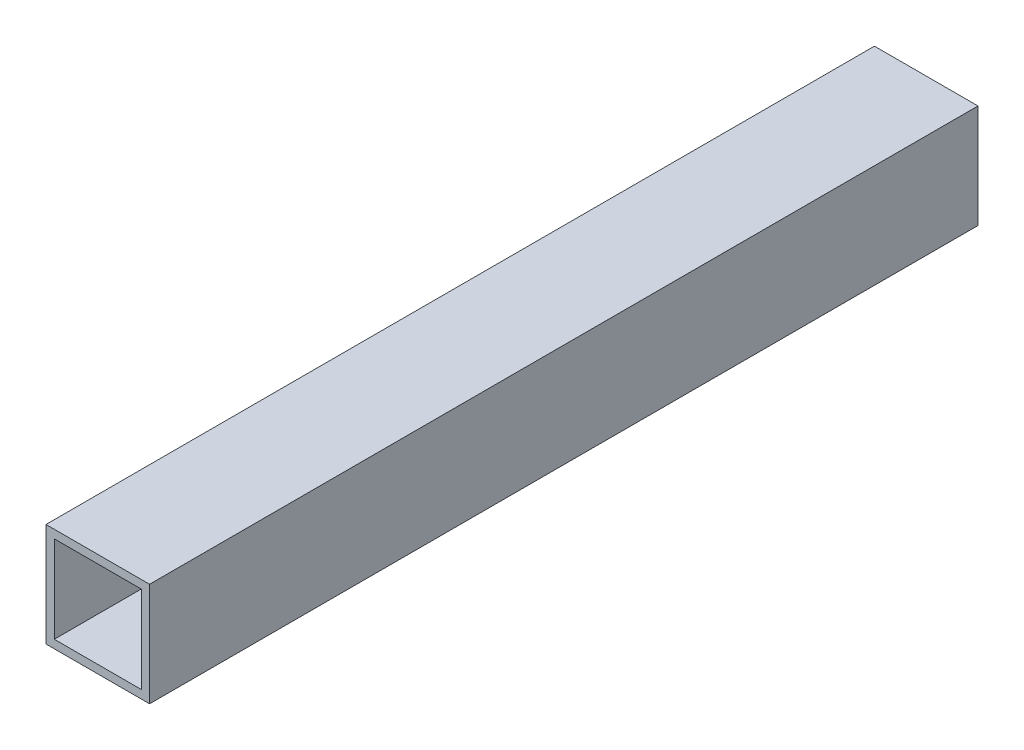
ISO-10303-21;
HEADER;
FILE_DESCRIPTION(('STEP AP214'),'2;1');
FILE_NAME('part.step','',(''),(''),'','','');
FILE_SCHEMA(('AUTOMOTIVE_DESIGN { 1 0 10303 214 1 1 1 1 }'));
ENDSEC;
DATA;
#1=APPLICATION_CONTEXT('core data for automotive mechanical design processes');
#2=APPLICATION_PROTOCOL_DEFINITION('international standard','automotive_design',2000,#1);
#3=PRODUCT_CONTEXT('',#1,'mechanical');
#4=PRODUCT('Part','Part','',(#3));
#5=PRODUCT_RELATED_PRODUCT_CATEGORY('part','',(#4));
#6=PRODUCT_DEFINITION_FORMATION('','',#4);
#7=PRODUCT_DEFINITION_CONTEXT('part definition',#1,'design');
#8=PRODUCT_DEFINITION('design','',#6,#7);
#9=PRODUCT_DEFINITION_SHAPE('','',#8);
#10=(LENGTH_UNIT() NAMED_UNIT(*) SI_UNIT(.MILLI.,.METRE.));
#11=(NAMED_UNIT(*) PLANE_ANGLE_UNIT() SI_UNIT($,.RADIAN.));
#12=(NAMED_UNIT(*) SI_UNIT($,.STERADIAN.) SOLID_ANGLE_UNIT());
#13=UNCERTAINTY_MEASURE_WITH_UNIT(LENGTH_MEASURE(1.E-05),#10,'distance_accuracy_value','');
#14=(GEOMETRIC_REPRESENTATION_CONTEXT(3) GLOBAL_UNCERTAINTY_ASSIGNED_CONTEXT((#13)) GLOBAL_UNIT_ASSIGNED_CONTEXT((#10,
#11,#12)) REPRESENTATION_CONTEXT('',''));
#15=CARTESIAN_POINT('',(0.,0.,0.));
#16=DIRECTION('',(0.,0.,1.));
#17=DIRECTION('',(1.,0.,0.));
#18=AXIS2_PLACEMENT_3D('',#15,#16,#17);
#19=CARTESIAN_POINT('',(0.,0.,304.8));
#20=DIRECTION('',(0.,0.,1.));
#21=DIRECTION('',(1.,0.,0.));
#22=AXIS2_PLACEMENT_3D('',#19,#20,#21);
#23=PLANE('',#22);
#24=DIRECTION('',(0.,1.,0.));
#25=VECTOR('',#24,1.);
#26=CARTESIAN_POINT('',(19.05,19.05,304.8));
#27=LINE('',#26,#25);
#28=CARTESIAN_POINT('',(19.05,-19.05,304.8));
#29=VERTEX_POINT('',#28);
#30=CARTESIAN_POINT('',(19.05,19.05,304.8));
#31=VERTEX_POINT('',#30);
#32=EDGE_CURVE('E159',#29,#31,#27,.T.);
#33=ORIENTED_EDGE('',*,*,#32,.T.);
#34=DIRECTION('',(-1.,0.,0.));
#35=VECTOR('',#34,1.);
#36=CARTESIAN_POINT('',(-19.05,19.05,304.8));
#37=LINE('',#36,#35);
#38=CARTESIAN_POINT('',(-19.05,19.05,304.8));
#39=VERTEX_POINT('',#38);
#40=EDGE_CURVE('E163',#31,#39,#37,.T.);
#41=ORIENTED_EDGE('',*,*,#40,.T.);
#42=DIRECTION('',(0.,-1.,0.));
#43=VECTOR('',#42,1.);
#44=CARTESIAN_POINT('',(-19.05,19.05,304.8));
#45=LINE('',#44,#43);
#46=CARTESIAN_POINT('',(-19.05,-19.05,304.8));
#47=VERTEX_POINT('',#46);
#48=EDGE_CURVE('E167',#39,#47,#45,.T.);
#49=ORIENTED_EDGE('',*,*,#48,.T.);
#50=DIRECTION('',(1.,0.,0.));
#51=VECTOR('',#50,1.);
#52=CARTESIAN_POINT('',(-19.05,-19.05,304.8));
#53=LINE('',#52,#51);
#54=EDGE_CURVE('E170',#47,#29,#53,.T.);
#55=ORIENTED_EDGE('',*,*,#54,.T.);
#56=EDGE_LOOP('',(#33,#41,#49,#55));
#57=FACE_BOUND('',#56,.T.);
#58=DIRECTION('',(-1.,0.,0.));
#59=VECTOR('',#58,1.);
#60=CARTESIAN_POINT('',(-16.002,16.002,304.8));
#61=LINE('',#60,#59);
#62=CARTESIAN_POINT('',(16.002,16.002,304.8));
#63=VERTEX_POINT('',#62);
#64=CARTESIAN_POINT('',(-16.002,16.002,304.8));
#65=VERTEX_POINT('',#64);
#66=EDGE_CURVE('E120',#63,#65,#61,.T.);
#67=ORIENTED_EDGE('',*,*,#66,.F.);
#68=DIRECTION('',(0.,1.,0.));
#69=VECTOR('',#68,1.);
#70=CARTESIAN_POINT('',(16.002,-16.002,304.8));
#71=LINE('',#70,#69);
#72=CARTESIAN_POINT('',(16.002,-16.002,304.8));
#73=VERTEX_POINT('',#72);
#74=EDGE_CURVE('E111',#73,#63,#71,.T.);
#75=ORIENTED_EDGE('',*,*,#74,.F.);
#76=DIRECTION('',(1.,0.,0.));
#77=VECTOR('',#76,1.);
#78=CARTESIAN_POINT('',(-16.002,-16.002,304.8));
#79=LINE('',#78,#77);
#80=CARTESIAN_POINT('',(-16.002,-16.002,304.8));
#81=VERTEX_POINT('',#80);
#82=EDGE_CURVE('E137',#81,#73,#79,.T.);
#83=ORIENTED_EDGE('',*,*,#82,.F.);
#84=DIRECTION('',(0.,-1.,0.));
#85=VECTOR('',#84,1.);
#86=CARTESIAN_POINT('',(-16.002,-16.002,304.8));
#87=LINE('',#86,#85);
#88=EDGE_CURVE('E133',#65,#81,#87,.T.);
#89=ORIENTED_EDGE('',*,*,#88,.F.);
#90=EDGE_LOOP('',(#67,#75,#83,#89));
#91=FACE_BOUND('',#90,.T.);
#92=ADVANCED_FACE('F45',(#57,#91),#23,.T.);
#93=CARTESIAN_POINT('',(0.,0.,0.));
#94=DIRECTION('',(0.,0.,1.));
#95=DIRECTION('',(1.,0.,0.));
#96=AXIS2_PLACEMENT_3D('',#93,#94,#95);
#97=PLANE('',#96);
#98=DIRECTION('',(0.,1.,0.));
#99=VECTOR('',#98,1.);
#100=CARTESIAN_POINT('',(19.05,19.05,0.));
#101=LINE('',#100,#99);
#102=CARTESIAN_POINT('',(19.05,-19.05,0.));
#103=VERTEX_POINT('',#102);
#104=CARTESIAN_POINT('',(19.05,19.05,0.));
#105=VERTEX_POINT('',#104);
#106=EDGE_CURVE('E129',#103,#105,#101,.T.);
#107=ORIENTED_EDGE('',*,*,#106,.F.);
#108=DIRECTION('',(1.,0.,0.));
#109=VECTOR('',#108,1.);
#110=CARTESIAN_POINT('',(-19.05,-19.05,0.));
#111=LINE('',#110,#109);
#112=CARTESIAN_POINT('',(-19.05,-19.05,0.));
#113=VERTEX_POINT('',#112);
#114=EDGE_CURVE('E164',#113,#103,#111,.T.);
#115=ORIENTED_EDGE('',*,*,#114,.F.);
#116=DIRECTION('',(0.,-1.,0.));
#117=VECTOR('',#116,1.);
#118=CARTESIAN_POINT('',(-19.05,19.05,0.));
#119=LINE('',#118,#117);
#120=CARTESIAN_POINT('',(-19.05,19.05,0.));
#121=VERTEX_POINT('',#120);
#122=EDGE_CURVE('E180',#121,#113,#119,.T.);
#123=ORIENTED_EDGE('',*,*,#122,.F.);
#124=DIRECTION('',(-1.,0.,0.));
#125=VECTOR('',#124,1.);
#126=CARTESIAN_POINT('',(-19.05,19.05,0.));
#127=LINE('',#126,#125);
#128=EDGE_CURVE('E177',#105,#121,#127,.T.);
#129=ORIENTED_EDGE('',*,*,#128,.F.);
#130=EDGE_LOOP('',(#107,#115,#123,#129));
#131=FACE_BOUND('',#130,.T.);
#132=DIRECTION('',(0.,1.,0.));
#133=VECTOR('',#132,1.);
#134=CARTESIAN_POINT('',(16.002,-16.002,0.));
#135=LINE('',#134,#133);
#136=CARTESIAN_POINT('',(16.002,-16.002,0.));
#137=VERTEX_POINT('',#136);
#138=CARTESIAN_POINT('',(16.002,16.002,0.));
#139=VERTEX_POINT('',#138);
#140=EDGE_CURVE('E69',#137,#139,#135,.T.);
#141=ORIENTED_EDGE('',*,*,#140,.T.);
#142=DIRECTION('',(-1.,0.,0.));
#143=VECTOR('',#142,1.);
#144=CARTESIAN_POINT('',(-16.002,16.002,0.));
#145=LINE('',#144,#143);
#146=CARTESIAN_POINT('',(-16.002,16.002,0.));
#147=VERTEX_POINT('',#146);
#148=EDGE_CURVE('E127',#139,#147,#145,.T.);
#149=ORIENTED_EDGE('',*,*,#148,.T.);
#150=DIRECTION('',(0.,-1.,0.));
#151=VECTOR('',#150,1.);
#152=CARTESIAN_POINT('',(-16.002,-16.002,0.));
#153=LINE('',#152,#151);
#154=CARTESIAN_POINT('',(-16.002,-16.002,0.));
#155=VERTEX_POINT('',#154);
#156=EDGE_CURVE('E146',#147,#155,#153,.T.);
#157=ORIENTED_EDGE('',*,*,#156,.T.);
#158=DIRECTION('',(1.,0.,0.));
#159=VECTOR('',#158,1.);
#160=CARTESIAN_POINT('',(-16.002,-16.002,0.));
#161=LINE('',#160,#159);
#162=EDGE_CURVE('E121',#155,#137,#161,.T.);
#163=ORIENTED_EDGE('',*,*,#162,.T.);
#164=EDGE_LOOP('',(#141,#149,#157,#163));
#165=FACE_BOUND('',#164,.T.);
#166=ADVANCED_FACE('F203',(#131,#165),#97,.F.);
#167=CARTESIAN_POINT('',(19.05,19.05,304.8));
#168=DIRECTION('',(-1.,0.,0.));
#169=DIRECTION('',(0.,-1.,0.));
#170=AXIS2_PLACEMENT_3D('',#167,#168,#169);
#171=PLANE('',#170);
#172=ORIENTED_EDGE('',*,*,#106,.T.);
#173=DIRECTION('',(0.,0.,-1.));
#174=VECTOR('',#173,1.);
#175=CARTESIAN_POINT('',(19.05,19.05,304.8));
#176=LINE('',#175,#174);
#177=EDGE_CURVE('E11',#31,#105,#176,.T.);
#178=ORIENTED_EDGE('',*,*,#177,.F.);
#179=ORIENTED_EDGE('',*,*,#32,.F.);
#180=DIRECTION('',(0.,0.,-1.));
#181=VECTOR('',#180,1.);
#182=CARTESIAN_POINT('',(19.05,-19.05,304.8));
#183=LINE('',#182,#181);
#184=EDGE_CURVE('E173',#29,#103,#183,.T.);
#185=ORIENTED_EDGE('',*,*,#184,.T.);
#186=EDGE_LOOP('',(#172,#178,#179,#185));
#187=FACE_BOUND('',#186,.T.);
#188=ADVANCED_FACE('F47',(#187),#171,.F.);
#189=CARTESIAN_POINT('',(-19.05,19.05,304.8));
#190=DIRECTION('',(0.,-1.,0.));
#191=DIRECTION('',(0.,0.,-1.));
#192=AXIS2_PLACEMENT_3D('',#189,#190,#191);
#193=PLANE('',#192);
#194=ORIENTED_EDGE('',*,*,#128,.T.);
#195=DIRECTION('',(0.,0.,-1.));
#196=VECTOR('',#195,1.);
#197=CARTESIAN_POINT('',(-19.05,19.05,304.8));
#198=LINE('',#197,#196);
#199=EDGE_CURVE('E54',#39,#121,#198,.T.);
#200=ORIENTED_EDGE('',*,*,#199,.F.);
#201=ORIENTED_EDGE('',*,*,#40,.F.);
#202=ORIENTED_EDGE('',*,*,#177,.T.);
#203=EDGE_LOOP('',(#194,#200,#201,#202));
#204=FACE_BOUND('',#203,.T.);
#205=ADVANCED_FACE('F213',(#204),#193,.F.);
#206=CARTESIAN_POINT('',(-19.05,19.05,304.8));
#207=DIRECTION('',(1.,0.,0.));
#208=DIRECTION('',(0.,1.,0.));
#209=AXIS2_PLACEMENT_3D('',#206,#207,#208);
#210=PLANE('',#209);
#211=ORIENTED_EDGE('',*,*,#122,.T.);
#212=DIRECTION('',(0.,0.,-1.));
#213=VECTOR('',#212,1.);
#214=CARTESIAN_POINT('',(-19.05,-19.05,304.8));
#215=LINE('',#214,#213);
#216=EDGE_CURVE('E188',#47,#113,#215,.T.);
#217=ORIENTED_EDGE('',*,*,#216,.F.);
#218=ORIENTED_EDGE('',*,*,#48,.F.);
#219=ORIENTED_EDGE('',*,*,#199,.T.);
#220=EDGE_LOOP('',(#211,#217,#218,#219));
#221=FACE_BOUND('',#220,.T.);
#222=ADVANCED_FACE('F197',(#221),#210,.F.);
#223=CARTESIAN_POINT('',(-19.05,-19.05,304.8));
#224=DIRECTION('',(0.,1.,0.));
#225=DIRECTION('',(0.,0.,1.));
#226=AXIS2_PLACEMENT_3D('',#223,#224,#225);
#227=PLANE('',#226);
#228=ORIENTED_EDGE('',*,*,#114,.T.);
#229=ORIENTED_EDGE('',*,*,#184,.F.);
#230=ORIENTED_EDGE('',*,*,#54,.F.);
#231=ORIENTED_EDGE('',*,*,#216,.T.);
#232=EDGE_LOOP('',(#228,#229,#230,#231));
#233=FACE_BOUND('',#232,.T.);
#234=ADVANCED_FACE('F207',(#233),#227,.F.);
#235=CARTESIAN_POINT('',(16.002,-16.002,304.8));
#236=DIRECTION('',(-1.,0.,0.));
#237=DIRECTION('',(0.,-1.,0.));
#238=AXIS2_PLACEMENT_3D('',#235,#236,#237);
#239=PLANE('',#238);
#240=ORIENTED_EDGE('',*,*,#140,.F.);
#241=DIRECTION('',(0.,0.,-1.));
#242=VECTOR('',#241,1.);
#243=CARTESIAN_POINT('',(16.002,-16.002,304.8));
#244=LINE('',#243,#242);
#245=EDGE_CURVE('E115',#73,#137,#244,.T.);
#246=ORIENTED_EDGE('',*,*,#245,.F.);
#247=ORIENTED_EDGE('',*,*,#74,.T.);
#248=DIRECTION('',(0.,0.,-1.));
#249=VECTOR('',#248,1.);
#250=CARTESIAN_POINT('',(16.002,16.002,304.8));
#251=LINE('',#250,#249);
#252=EDGE_CURVE('E114',#63,#139,#251,.T.);
#253=ORIENTED_EDGE('',*,*,#252,.T.);
#254=EDGE_LOOP('',(#240,#246,#247,#253));
#255=FACE_BOUND('',#254,.T.);
#256=ADVANCED_FACE('F113',(#255),#239,.T.);
#257=CARTESIAN_POINT('',(-16.002,16.002,304.8));
#258=DIRECTION('',(0.,-1.,0.));
#259=DIRECTION('',(0.,0.,-1.));
#260=AXIS2_PLACEMENT_3D('',#257,#258,#259);
#261=PLANE('',#260);
#262=ORIENTED_EDGE('',*,*,#148,.F.);
#263=ORIENTED_EDGE('',*,*,#252,.F.);
#264=ORIENTED_EDGE('',*,*,#66,.T.);
#265=DIRECTION('',(0.,0.,-1.));
#266=VECTOR('',#265,1.);
#267=CARTESIAN_POINT('',(-16.002,16.002,304.8));
#268=LINE('',#267,#266);
#269=EDGE_CURVE('E130',#65,#147,#268,.T.);
#270=ORIENTED_EDGE('',*,*,#269,.T.);
#271=EDGE_LOOP('',(#262,#263,#264,#270));
#272=FACE_BOUND('',#271,.T.);
#273=ADVANCED_FACE('F124',(#272),#261,.T.);
#274=CARTESIAN_POINT('',(-16.002,-16.002,304.8));
#275=DIRECTION('',(1.,0.,0.));
#276=DIRECTION('',(0.,0.,-1.));
#277=AXIS2_PLACEMENT_3D('',#274,#275,#276);
#278=PLANE('',#277);
#279=ORIENTED_EDGE('',*,*,#156,.F.);
#280=ORIENTED_EDGE('',*,*,#269,.F.);
#281=ORIENTED_EDGE('',*,*,#88,.T.);
#282=DIRECTION('',(0.,0.,-1.));
#283=VECTOR('',#282,1.);
#284=CARTESIAN_POINT('',(-16.002,-16.002,304.8));
#285=LINE('',#284,#283);
#286=EDGE_CURVE('E61',#81,#155,#285,.T.);
#287=ORIENTED_EDGE('',*,*,#286,.T.);
#288=EDGE_LOOP('',(#279,#280,#281,#287));
#289=FACE_BOUND('',#288,.T.);
#290=ADVANCED_FACE('F236',(#289),#278,.T.);
#291=CARTESIAN_POINT('',(-16.002,-16.002,304.8));
#292=DIRECTION('',(0.,1.,0.));
#293=DIRECTION('',(0.,0.,1.));
#294=AXIS2_PLACEMENT_3D('',#291,#292,#293);
#295=PLANE('',#294);
#296=ORIENTED_EDGE('',*,*,#162,.F.);
#297=ORIENTED_EDGE('',*,*,#286,.F.);
#298=ORIENTED_EDGE('',*,*,#82,.T.);
#299=ORIENTED_EDGE('',*,*,#245,.T.);
#300=EDGE_LOOP('',(#296,#297,#298,#299));
#301=FACE_BOUND('',#300,.T.);
#302=ADVANCED_FACE('F240',(#301),#295,.T.);
#303=CLOSED_SHELL('',(#92,#166,#188,#205,#222,#234,#256,#273,#290,#302));
#304=MANIFOLD_SOLID_BREP('B2',#303);
#305=ADVANCED_BREP_SHAPE_REPRESENTATION('',(#18,#304),#14);
#306=SHAPE_DEFINITION_REPRESENTATION(#9,#305);
ENDSEC;
END-ISO-10303-21;
